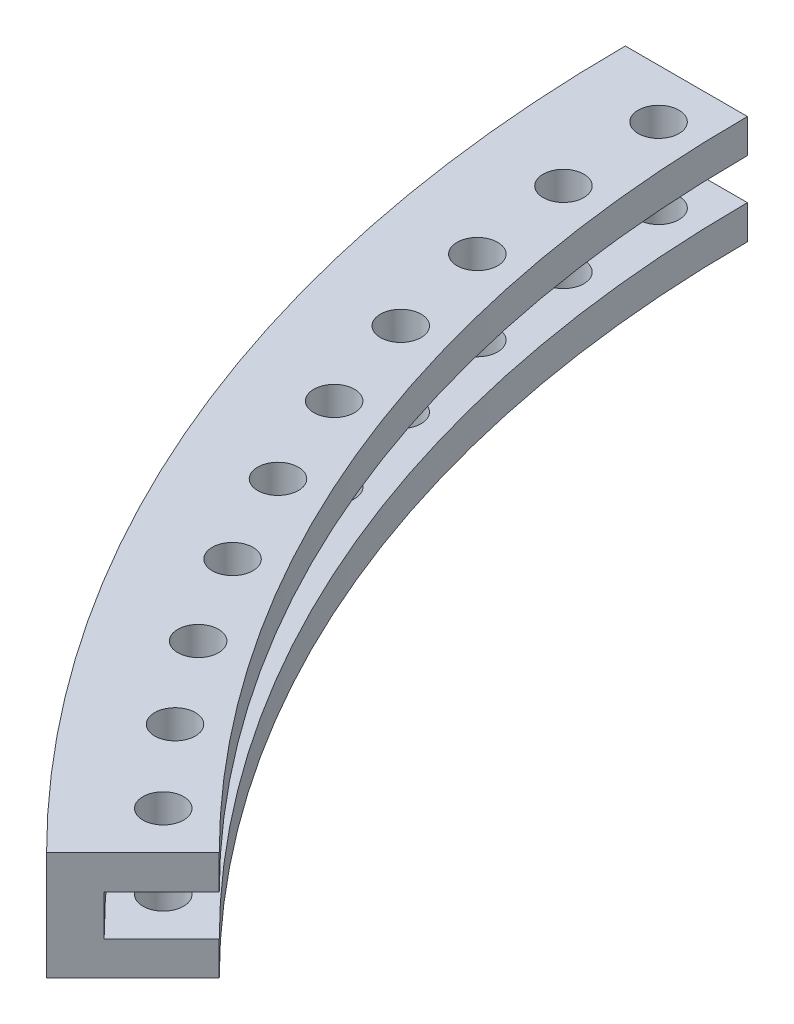
ISO-10303-21;
HEADER;
FILE_DESCRIPTION(('STEP AP214'),'2;1');
FILE_NAME('part.step','',(''),(''),'','','');
FILE_SCHEMA(('AUTOMOTIVE_DESIGN { 1 0 10303 214 1 1 1 1 }'));
ENDSEC;
DATA;
#1=APPLICATION_CONTEXT('core data for automotive mechanical design processes');
#2=APPLICATION_PROTOCOL_DEFINITION('international standard','automotive_design',2000,#1);
#3=PRODUCT_CONTEXT('',#1,'mechanical');
#4=PRODUCT('Part','Part','',(#3));
#5=PRODUCT_RELATED_PRODUCT_CATEGORY('part','',(#4));
#6=PRODUCT_DEFINITION_FORMATION('','',#4);
#7=PRODUCT_DEFINITION_CONTEXT('part definition',#1,'design');
#8=PRODUCT_DEFINITION('design','',#6,#7);
#9=PRODUCT_DEFINITION_SHAPE('','',#8);
#10=(LENGTH_UNIT() NAMED_UNIT(*) SI_UNIT(.MILLI.,.METRE.));
#11=(NAMED_UNIT(*) PLANE_ANGLE_UNIT() SI_UNIT($,.RADIAN.));
#12=(NAMED_UNIT(*) SI_UNIT($,.STERADIAN.) SOLID_ANGLE_UNIT());
#13=UNCERTAINTY_MEASURE_WITH_UNIT(LENGTH_MEASURE(1.E-05),#10,'distance_accuracy_value','');
#14=(GEOMETRIC_REPRESENTATION_CONTEXT(3) GLOBAL_UNCERTAINTY_ASSIGNED_CONTEXT((#13)) GLOBAL_UNIT_ASSIGNED_CONTEXT((#10,
#11,#12)) REPRESENTATION_CONTEXT('',''));
#15=CARTESIAN_POINT('',(0.,0.,0.));
#16=DIRECTION('',(0.,0.,1.));
#17=DIRECTION('',(1.,0.,0.));
#18=AXIS2_PLACEMENT_3D('',#15,#16,#17);
#19=CARTESIAN_POINT('',(-66.4680374315354,4.,66.4680374315356));
#20=DIRECTION('',(0.,-1.,0.));
#21=DIRECTION('',(0.,0.,-1.));
#22=AXIS2_PLACEMENT_3D('',#19,#20,#21);
#23=PLANE('',#22);
#24=CARTESIAN_POINT('',(-80.7590380226846,4.,53.7306037342833));
#25=DIRECTION('',(0.,1.,0.));
#26=DIRECTION('',(-0.156434465040231,0.,0.987688340595138));
#27=AXIS2_PLACEMENT_3D('',#24,#25,#26);
#28=CIRCLE('',#27,1.5);
#29=CARTESIAN_POINT('',(-80.993689720245,4.,55.212136245176));
#30=VERTEX_POINT('',#29);
#31=EDGE_CURVE('E587',#30,#30,#28,.T.);
#32=ORIENTED_EDGE('',*,*,#31,.F.);
#33=EDGE_LOOP('',(#32));
#34=FACE_BOUND('',#33,.T.);
#35=CARTESIAN_POINT('',(-84.7257394423301,4.,47.2286891195425));
#36=DIRECTION('',(0.,1.,0.));
#37=DIRECTION('',(-0.233445363855906,0.,0.972369920397676));
#38=AXIS2_PLACEMENT_3D('',#35,#36,#37);
#39=CIRCLE('',#38,1.5);
#40=CARTESIAN_POINT('',(-85.0759074881139,4.,48.687244000139));
#41=VERTEX_POINT('',#40);
#42=EDGE_CURVE('E583',#41,#41,#39,.T.);
#43=ORIENTED_EDGE('',*,*,#42,.F.);
#44=EDGE_LOOP('',(#43));
#45=FACE_BOUND('',#44,.T.);
#46=CARTESIAN_POINT('',(-88.1700785041463,4.,40.4355939312468));
#47=DIRECTION('',(0.,1.,0.));
#48=DIRECTION('',(-0.309016994374948,0.,0.951056516295154));
#49=AXIS2_PLACEMENT_3D('',#46,#47,#48);
#50=CIRCLE('',#49,1.5);
#51=CARTESIAN_POINT('',(-88.6336039957087,4.,41.8621787056896));
#52=VERTEX_POINT('',#51);
#53=EDGE_CURVE('E579',#52,#52,#50,.T.);
#54=ORIENTED_EDGE('',*,*,#53,.F.);
#55=EDGE_LOOP('',(#54));
#56=FACE_BOUND('',#55,.T.);
#57=CARTESIAN_POINT('',(-91.070819712458,4.,33.3931998601656));
#58=DIRECTION('',(0.,1.,0.));
#59=DIRECTION('',(-0.382683432365091,0.,0.923879532511287));
#60=AXIS2_PLACEMENT_3D('',#57,#58,#59);
#61=CIRCLE('',#60,1.5);
#62=CARTESIAN_POINT('',(-91.6448448610057,4.,34.7790191589325));
#63=VERTEX_POINT('',#62);
#64=EDGE_CURVE('E575',#63,#63,#61,.T.);
#65=ORIENTED_EDGE('',*,*,#64,.F.);
#66=EDGE_LOOP('',(#65));
#67=FACE_BOUND('',#66,.T.);
#68=CARTESIAN_POINT('',(-93.4100790331218,4.,26.1449256075807));
#69=DIRECTION('',(0.,1.,0.));
#70=DIRECTION('',(-0.453990499739548,0.,0.891006524188367));
#71=AXIS2_PLACEMENT_3D('',#68,#69,#70);
#72=CIRCLE('',#71,1.5);
#73=CARTESIAN_POINT('',(-94.0910647827312,4.,27.4814353938633));
#74=VERTEX_POINT('',#73);
#75=EDGE_CURVE('E571',#74,#74,#72,.T.);
#76=ORIENTED_EDGE('',*,*,#75,.F.);
#77=EDGE_LOOP('',(#76));
#78=FACE_BOUND('',#77,.T.);
#79=CARTESIAN_POINT('',(-95.1734341545432,4.,18.7354591945551));
#80=DIRECTION('',(0.,1.,0.));
#81=DIRECTION('',(-0.52249856471595,0.,0.852640164354092));
#82=AXIS2_PLACEMENT_3D('',#79,#80,#81);
#83=CIRCLE('',#82,1.5);
#84=CARTESIAN_POINT('',(-95.9571820016171,4.,20.0144194410862));
#85=VERTEX_POINT('',#84);
#86=EDGE_CURVE('E567',#85,#85,#83,.T.);
#87=ORIENTED_EDGE('',*,*,#86,.F.);
#88=EDGE_LOOP('',(#87));
#89=FACE_BOUND('',#88,.T.);
#90=CARTESIAN_POINT('',(-96.3500134060233,4.,11.2104824454226));
#91=DIRECTION('',(0.,1.,0.));
#92=DIRECTION('',(-0.587785252292474,0.,0.809016994374947));
#93=AXIS2_PLACEMENT_3D('',#90,#91,#92);
#94=CIRCLE('',#93,1.5);
#95=CARTESIAN_POINT('',(-97.231691284462,4.,12.424007936985));
#96=VERTEX_POINT('',#95);
#97=EDGE_CURVE('E563',#96,#96,#94,.T.);
#98=ORIENTED_EDGE('',*,*,#97,.F.);
#99=EDGE_LOOP('',(#98));
#100=FACE_BOUND('',#99,.T.);
#101=CARTESIAN_POINT('',(-96.9325627852246,4.,3.61638934415037));
#102=DIRECTION('',(0.,1.,0.));
#103=DIRECTION('',(-0.649448048330185,0.,0.76040596560003));
#104=AXIS2_PLACEMENT_3D('',#101,#102,#103);
#105=CIRCLE('',#104,1.5);
#106=CARTESIAN_POINT('',(-97.9067348577199,4.,4.75699829255041));
#107=VERTEX_POINT('',#106);
#108=EDGE_CURVE('E558',#107,#107,#105,.T.);
#109=ORIENTED_EDGE('',*,*,#108,.F.);
#110=EDGE_LOOP('',(#109));
#111=FACE_BOUND('',#110,.T.);
#112=CARTESIAN_POINT('',(-76.294430278524,4.,59.9012513097635));
#113=DIRECTION('',(0.,1.,0.));
#114=DIRECTION('',(-0.0784590957278451,0.,0.996917333733128));
#115=AXIS2_PLACEMENT_3D('',#112,#113,#114);
#116=CIRCLE('',#115,1.5);
#117=CARTESIAN_POINT('',(-76.4121189221158,4.,61.3966273103632));
#118=VERTEX_POINT('',#117);
#119=EDGE_CURVE('E216',#118,#118,#116,.T.);
#120=ORIENTED_EDGE('',*,*,#119,.F.);
#121=EDGE_LOOP('',(#120));
#122=FACE_BOUND('',#121,.T.);
#123=CARTESIAN_POINT('',(-71.3594420012237,4.,65.7025877517316));
#124=DIRECTION('',(0.,1.,0.));
#125=DIRECTION('',(0.,0.,1.));
#126=AXIS2_PLACEMENT_3D('',#123,#124,#125);
#127=CIRCLE('',#126,1.5);
#128=CARTESIAN_POINT('',(-71.3594420012237,4.,67.2025877517316));
#129=VERTEX_POINT('',#128);
#130=EDGE_CURVE('E223',#129,#129,#127,.T.);
#131=ORIENTED_EDGE('',*,*,#130,.F.);
#132=EDGE_LOOP('',(#131));
#133=FACE_BOUND('',#132,.T.);
#134=CARTESIAN_POINT('',(0.,4.,0.));
#135=DIRECTION('',(0.,-1.,0.));
#136=DIRECTION('',(0.,0.,-1.));
#137=AXIS2_PLACEMENT_3D('',#134,#135,#136);
#138=CIRCLE('',#137,103.);
#139=CARTESIAN_POINT('',(-72.8319984622143,4.,72.8319984622145));
#140=VERTEX_POINT('',#139);
#141=CARTESIAN_POINT('',(-103.,4.,0.));
#142=VERTEX_POINT('',#141);
#143=EDGE_CURVE('E11',#140,#142,#138,.T.);
#144=ORIENTED_EDGE('',*,*,#143,.F.);
#145=DIRECTION('',(-0.707106781186546,0.,0.707106781186549));
#146=VECTOR('',#145,1.);
#147=CARTESIAN_POINT('',(-66.4680374315354,4.,66.4680374315356));
#148=LINE('',#147,#146);
#149=CARTESIAN_POINT('',(-66.4680374315354,4.,66.4680374315356));
#150=VERTEX_POINT('',#149);
#151=EDGE_CURVE('E135',#150,#140,#148,.T.);
#152=ORIENTED_EDGE('',*,*,#151,.F.);
#153=CARTESIAN_POINT('',(0.,4.,0.));
#154=DIRECTION('',(0.,-1.,0.));
#155=DIRECTION('',(0.,0.,-1.));
#156=AXIS2_PLACEMENT_3D('',#153,#154,#155);
#157=CIRCLE('',#156,94.);
#158=CARTESIAN_POINT('',(-94.,4.,0.));
#159=VERTEX_POINT('',#158);
#160=EDGE_CURVE('E49',#150,#159,#157,.T.);
#161=ORIENTED_EDGE('',*,*,#160,.T.);
#162=DIRECTION('',(-1.,0.,0.));
#163=VECTOR('',#162,1.);
#164=CARTESIAN_POINT('',(-94.,4.,0.));
#165=LINE('',#164,#163);
#166=EDGE_CURVE('E109',#159,#142,#165,.T.);
#167=ORIENTED_EDGE('',*,*,#166,.T.);
#168=EDGE_LOOP('',(#144,#152,#161,#167));
#169=FACE_BOUND('',#168,.T.);
#170=ADVANCED_FACE('F32',(#34,#45,#56,#67,#78,#89,#100,#111,#122,#133,#169),#23,.F.);
#171=CARTESIAN_POINT('',(0.,-55.,0.));
#172=DIRECTION('',(0.,-1.,0.));
#173=DIRECTION('',(0.,0.,-1.));
#174=AXIS2_PLACEMENT_3D('',#171,#172,#173);
#175=CYLINDRICAL_SURFACE('',#174,103.);
#176=CARTESIAN_POINT('',(0.,-4.,0.));
#177=DIRECTION('',(0.,-1.,0.));
#178=DIRECTION('',(0.,0.,-1.));
#179=AXIS2_PLACEMENT_3D('',#176,#177,#178);
#180=CIRCLE('',#179,103.);
#181=CARTESIAN_POINT('',(-72.8319984622143,-4.,72.8319984622145));
#182=VERTEX_POINT('',#181);
#183=CARTESIAN_POINT('',(-103.,-4.,0.));
#184=VERTEX_POINT('',#183);
#185=EDGE_CURVE('E41',#182,#184,#180,.T.);
#186=ORIENTED_EDGE('',*,*,#185,.F.);
#187=DIRECTION('',(0.,-1.,0.));
#188=VECTOR('',#187,1.);
#189=CARTESIAN_POINT('',(-72.8319984622143,4.,72.8319984622145));
#190=LINE('',#189,#188);
#191=EDGE_CURVE('E105',#140,#182,#190,.T.);
#192=ORIENTED_EDGE('',*,*,#191,.F.);
#193=ORIENTED_EDGE('',*,*,#143,.T.);
#194=DIRECTION('',(0.,-1.,0.));
#195=VECTOR('',#194,1.);
#196=CARTESIAN_POINT('',(-103.,4.,0.));
#197=LINE('',#196,#195);
#198=EDGE_CURVE('E102',#142,#184,#197,.T.);
#199=ORIENTED_EDGE('',*,*,#198,.T.);
#200=EDGE_LOOP('',(#186,#192,#193,#199));
#201=FACE_BOUND('',#200,.T.);
#202=ADVANCED_FACE('F34',(#201),#175,.T.);
#203=CARTESIAN_POINT('',(-72.8319984622143,-4.,72.8319984622145));
#204=DIRECTION('',(0.,1.,0.));
#205=DIRECTION('',(0.,0.,1.));
#206=AXIS2_PLACEMENT_3D('',#203,#204,#205);
#207=PLANE('',#206);
#208=CARTESIAN_POINT('',(-80.7590380226846,-4.,53.7306037342833));
#209=DIRECTION('',(0.,1.,0.));
#210=DIRECTION('',(-0.156434465040231,0.,0.987688340595138));
#211=AXIS2_PLACEMENT_3D('',#208,#209,#210);
#212=CIRCLE('',#211,1.5);
#213=CARTESIAN_POINT('',(-80.993689720245,-4.,55.212136245176));
#214=VERTEX_POINT('',#213);
#215=EDGE_CURVE('E179',#214,#214,#212,.T.);
#216=ORIENTED_EDGE('',*,*,#215,.T.);
#217=EDGE_LOOP('',(#216));
#218=FACE_BOUND('',#217,.T.);
#219=CARTESIAN_POINT('',(-84.7257394423301,-4.,47.2286891195425));
#220=DIRECTION('',(0.,1.,0.));
#221=DIRECTION('',(-0.233445363855906,0.,0.972369920397676));
#222=AXIS2_PLACEMENT_3D('',#219,#220,#221);
#223=CIRCLE('',#222,1.5);
#224=CARTESIAN_POINT('',(-85.0759074881139,-4.,48.687244000139));
#225=VERTEX_POINT('',#224);
#226=EDGE_CURVE('E288',#225,#225,#223,.T.);
#227=ORIENTED_EDGE('',*,*,#226,.T.);
#228=EDGE_LOOP('',(#227));
#229=FACE_BOUND('',#228,.T.);
#230=CARTESIAN_POINT('',(-88.1700785041463,-4.,40.4355939312468));
#231=DIRECTION('',(0.,1.,0.));
#232=DIRECTION('',(-0.309016994374948,0.,0.951056516295154));
#233=AXIS2_PLACEMENT_3D('',#230,#231,#232);
#234=CIRCLE('',#233,1.5);
#235=CARTESIAN_POINT('',(-88.6336039957087,-4.,41.8621787056896));
#236=VERTEX_POINT('',#235);
#237=EDGE_CURVE('E292',#236,#236,#234,.T.);
#238=ORIENTED_EDGE('',*,*,#237,.T.);
#239=EDGE_LOOP('',(#238));
#240=FACE_BOUND('',#239,.T.);
#241=CARTESIAN_POINT('',(-91.070819712458,-4.,33.3931998601656));
#242=DIRECTION('',(0.,1.,0.));
#243=DIRECTION('',(-0.382683432365091,0.,0.923879532511287));
#244=AXIS2_PLACEMENT_3D('',#241,#242,#243);
#245=CIRCLE('',#244,1.5);
#246=CARTESIAN_POINT('',(-91.6448448610057,-4.,34.7790191589325));
#247=VERTEX_POINT('',#246);
#248=EDGE_CURVE('E296',#247,#247,#245,.T.);
#249=ORIENTED_EDGE('',*,*,#248,.T.);
#250=EDGE_LOOP('',(#249));
#251=FACE_BOUND('',#250,.T.);
#252=CARTESIAN_POINT('',(-93.4100790331218,-4.,26.1449256075807));
#253=DIRECTION('',(0.,1.,0.));
#254=DIRECTION('',(-0.453990499739548,0.,0.891006524188367));
#255=AXIS2_PLACEMENT_3D('',#252,#253,#254);
#256=CIRCLE('',#255,1.5);
#257=CARTESIAN_POINT('',(-94.0910647827312,-4.,27.4814353938633));
#258=VERTEX_POINT('',#257);
#259=EDGE_CURVE('E300',#258,#258,#256,.T.);
#260=ORIENTED_EDGE('',*,*,#259,.T.);
#261=EDGE_LOOP('',(#260));
#262=FACE_BOUND('',#261,.T.);
#263=CARTESIAN_POINT('',(-95.1734341545432,-4.,18.7354591945551));
#264=DIRECTION('',(0.,1.,0.));
#265=DIRECTION('',(-0.52249856471595,0.,0.852640164354092));
#266=AXIS2_PLACEMENT_3D('',#263,#264,#265);
#267=CIRCLE('',#266,1.5);
#268=CARTESIAN_POINT('',(-95.9571820016171,-4.,20.0144194410862));
#269=VERTEX_POINT('',#268);
#270=EDGE_CURVE('E304',#269,#269,#267,.T.);
#271=ORIENTED_EDGE('',*,*,#270,.T.);
#272=EDGE_LOOP('',(#271));
#273=FACE_BOUND('',#272,.T.);
#274=CARTESIAN_POINT('',(-96.3500134060233,-4.,11.2104824454226));
#275=DIRECTION('',(0.,1.,0.));
#276=DIRECTION('',(-0.587785252292474,0.,0.809016994374947));
#277=AXIS2_PLACEMENT_3D('',#274,#275,#276);
#278=CIRCLE('',#277,1.5);
#279=CARTESIAN_POINT('',(-97.231691284462,-4.,12.424007936985));
#280=VERTEX_POINT('',#279);
#281=EDGE_CURVE('E308',#280,#280,#278,.T.);
#282=ORIENTED_EDGE('',*,*,#281,.T.);
#283=EDGE_LOOP('',(#282));
#284=FACE_BOUND('',#283,.T.);
#285=CARTESIAN_POINT('',(-96.9325627852246,-4.,3.61638934415037));
#286=DIRECTION('',(0.,1.,0.));
#287=DIRECTION('',(-0.649448048330185,0.,0.76040596560003));
#288=AXIS2_PLACEMENT_3D('',#285,#286,#287);
#289=CIRCLE('',#288,1.5);
#290=CARTESIAN_POINT('',(-97.9067348577199,-4.,4.75699829255041));
#291=VERTEX_POINT('',#290);
#292=EDGE_CURVE('E312',#291,#291,#289,.T.);
#293=ORIENTED_EDGE('',*,*,#292,.T.);
#294=EDGE_LOOP('',(#293));
#295=FACE_BOUND('',#294,.T.);
#296=CARTESIAN_POINT('',(-76.294430278524,-4.,59.9012513097635));
#297=DIRECTION('',(0.,1.,0.));
#298=DIRECTION('',(-0.0784590957278451,0.,0.996917333733128));
#299=AXIS2_PLACEMENT_3D('',#296,#297,#298);
#300=CIRCLE('',#299,1.5);
#301=CARTESIAN_POINT('',(-76.4121189221158,-4.,61.3966273103632));
#302=VERTEX_POINT('',#301);
#303=EDGE_CURVE('E174',#302,#302,#300,.T.);
#304=ORIENTED_EDGE('',*,*,#303,.T.);
#305=EDGE_LOOP('',(#304));
#306=FACE_BOUND('',#305,.T.);
#307=CARTESIAN_POINT('',(-71.3594420012237,-4.,65.7025877517316));
#308=DIRECTION('',(0.,1.,0.));
#309=DIRECTION('',(0.,0.,1.));
#310=AXIS2_PLACEMENT_3D('',#307,#308,#309);
#311=CIRCLE('',#310,1.5);
#312=CARTESIAN_POINT('',(-71.3594420012237,-4.,67.2025877517316));
#313=VERTEX_POINT('',#312);
#314=EDGE_CURVE('E169',#313,#313,#311,.T.);
#315=ORIENTED_EDGE('',*,*,#314,.T.);
#316=EDGE_LOOP('',(#315));
#317=FACE_BOUND('',#316,.T.);
#318=CARTESIAN_POINT('',(0.,-4.,0.));
#319=DIRECTION('',(0.,-1.,0.));
#320=DIRECTION('',(0.,0.,-1.));
#321=AXIS2_PLACEMENT_3D('',#318,#319,#320);
#322=CIRCLE('',#321,94.);
#323=CARTESIAN_POINT('',(-66.4680374315354,-4.,66.4680374315356));
#324=VERTEX_POINT('',#323);
#325=CARTESIAN_POINT('',(-94.,-4.,0.));
#326=VERTEX_POINT('',#325);
#327=EDGE_CURVE('E163',#324,#326,#322,.T.);
#328=ORIENTED_EDGE('',*,*,#327,.F.);
#329=DIRECTION('',(0.707106781186546,0.,-0.707106781186549));
#330=VECTOR('',#329,1.);
#331=CARTESIAN_POINT('',(-72.8319984622143,-4.,72.8319984622145));
#332=LINE('',#331,#330);
#333=EDGE_CURVE('E138',#182,#324,#332,.T.);
#334=ORIENTED_EDGE('',*,*,#333,.F.);
#335=ORIENTED_EDGE('',*,*,#185,.T.);
#336=DIRECTION('',(1.,0.,0.));
#337=VECTOR('',#336,1.);
#338=CARTESIAN_POINT('',(-103.,-4.,0.));
#339=LINE('',#338,#337);
#340=EDGE_CURVE('E117',#184,#326,#339,.T.);
#341=ORIENTED_EDGE('',*,*,#340,.T.);
#342=EDGE_LOOP('',(#328,#334,#335,#341));
#343=FACE_BOUND('',#342,.T.);
#344=ADVANCED_FACE('F255',(#218,#229,#240,#251,#262,#273,#284,#295,#306,#317,#343),#207,.F.);
#345=CARTESIAN_POINT('',(0.,-55.,0.));
#346=DIRECTION('',(0.,-1.,0.));
#347=DIRECTION('',(0.,0.,-1.));
#348=AXIS2_PLACEMENT_3D('',#345,#346,#347);
#349=CYLINDRICAL_SURFACE('',#348,94.);
#350=CARTESIAN_POINT('',(0.,-1.5,0.));
#351=DIRECTION('',(0.,-1.,0.));
#352=DIRECTION('',(0.,0.,-1.));
#353=AXIS2_PLACEMENT_3D('',#350,#351,#352);
#354=CIRCLE('',#353,94.);
#355=CARTESIAN_POINT('',(-66.4680374315354,-1.5,66.4680374315356));
#356=VERTEX_POINT('',#355);
#357=CARTESIAN_POINT('',(-94.,-1.5,0.));
#358=VERTEX_POINT('',#357);
#359=EDGE_CURVE('E161',#356,#358,#354,.T.);
#360=ORIENTED_EDGE('',*,*,#359,.F.);
#361=DIRECTION('',(0.,1.,0.));
#362=VECTOR('',#361,1.);
#363=CARTESIAN_POINT('',(-66.4680374315354,-4.,66.4680374315356));
#364=LINE('',#363,#362);
#365=EDGE_CURVE('E141',#324,#356,#364,.T.);
#366=ORIENTED_EDGE('',*,*,#365,.F.);
#367=ORIENTED_EDGE('',*,*,#327,.T.);
#368=DIRECTION('',(0.,1.,0.));
#369=VECTOR('',#368,1.);
#370=CARTESIAN_POINT('',(-94.,-4.,0.));
#371=LINE('',#370,#369);
#372=EDGE_CURVE('E119',#326,#358,#371,.T.);
#373=ORIENTED_EDGE('',*,*,#372,.T.);
#374=EDGE_LOOP('',(#360,#366,#367,#373));
#375=FACE_BOUND('',#374,.T.);
#376=ADVANCED_FACE('F274',(#375),#349,.F.);
#377=CARTESIAN_POINT('',(-66.4680374315354,-1.5,66.4680374315356));
#378=DIRECTION('',(0.,-1.,0.));
#379=DIRECTION('',(0.,0.,-1.));
#380=AXIS2_PLACEMENT_3D('',#377,#378,#379);
#381=PLANE('',#380);
#382=CARTESIAN_POINT('',(-80.7590380226846,-1.5,53.7306037342833));
#383=DIRECTION('',(0.,-1.,0.));
#384=DIRECTION('',(0.,0.,-1.));
#385=AXIS2_PLACEMENT_3D('',#382,#383,#384);
#386=CIRCLE('',#385,1.5);
#387=CARTESIAN_POINT('',(-80.7590380226846,-1.5,52.2306037342833));
#388=VERTEX_POINT('',#387);
#389=EDGE_CURVE('E213',#388,#388,#386,.T.);
#390=ORIENTED_EDGE('',*,*,#389,.T.);
#391=EDGE_LOOP('',(#390));
#392=FACE_BOUND('',#391,.T.);
#393=CARTESIAN_POINT('',(-84.7257394423301,-1.5,47.2286891195425));
#394=DIRECTION('',(0.,-1.,0.));
#395=DIRECTION('',(0.,0.,-1.));
#396=AXIS2_PLACEMENT_3D('',#393,#394,#395);
#397=CIRCLE('',#396,1.5);
#398=CARTESIAN_POINT('',(-84.7257394423301,-1.5,45.7286891195425));
#399=VERTEX_POINT('',#398);
#400=EDGE_CURVE('E201',#399,#399,#397,.T.);
#401=ORIENTED_EDGE('',*,*,#400,.T.);
#402=EDGE_LOOP('',(#401));
#403=FACE_BOUND('',#402,.T.);
#404=CARTESIAN_POINT('',(-88.1700785041463,-1.5,40.4355939312468));
#405=DIRECTION('',(0.,-1.,0.));
#406=DIRECTION('',(0.,0.,-1.));
#407=AXIS2_PLACEMENT_3D('',#404,#405,#406);
#408=CIRCLE('',#407,1.5);
#409=CARTESIAN_POINT('',(-88.1700785041463,-1.5,38.9355939312469));
#410=VERTEX_POINT('',#409);
#411=EDGE_CURVE('E198',#410,#410,#408,.T.);
#412=ORIENTED_EDGE('',*,*,#411,.T.);
#413=EDGE_LOOP('',(#412));
#414=FACE_BOUND('',#413,.T.);
#415=CARTESIAN_POINT('',(-91.070819712458,-1.5,33.3931998601656));
#416=DIRECTION('',(0.,-1.,0.));
#417=DIRECTION('',(0.,0.,-1.));
#418=AXIS2_PLACEMENT_3D('',#415,#416,#417);
#419=CIRCLE('',#418,1.5);
#420=CARTESIAN_POINT('',(-91.070819712458,-1.5,31.8931998601656));
#421=VERTEX_POINT('',#420);
#422=EDGE_CURVE('E195',#421,#421,#419,.T.);
#423=ORIENTED_EDGE('',*,*,#422,.T.);
#424=EDGE_LOOP('',(#423));
#425=FACE_BOUND('',#424,.T.);
#426=CARTESIAN_POINT('',(-93.4100790331218,-1.5,26.1449256075807));
#427=DIRECTION('',(0.,-1.,0.));
#428=DIRECTION('',(0.,0.,-1.));
#429=AXIS2_PLACEMENT_3D('',#426,#427,#428);
#430=CIRCLE('',#429,1.5);
#431=CARTESIAN_POINT('',(-93.4100790331218,-1.5,24.6449256075807));
#432=VERTEX_POINT('',#431);
#433=EDGE_CURVE('E191',#432,#432,#430,.T.);
#434=ORIENTED_EDGE('',*,*,#433,.T.);
#435=EDGE_LOOP('',(#434));
#436=FACE_BOUND('',#435,.T.);
#437=CARTESIAN_POINT('',(-95.1734341545432,-1.5,18.7354591945551));
#438=DIRECTION('',(0.,-1.,0.));
#439=DIRECTION('',(0.,0.,-1.));
#440=AXIS2_PLACEMENT_3D('',#437,#438,#439);
#441=CIRCLE('',#440,1.5);
#442=CARTESIAN_POINT('',(-95.1734341545432,-1.5,17.2354591945551));
#443=VERTEX_POINT('',#442);
#444=EDGE_CURVE('E187',#443,#443,#441,.T.);
#445=ORIENTED_EDGE('',*,*,#444,.T.);
#446=EDGE_LOOP('',(#445));
#447=FACE_BOUND('',#446,.T.);
#448=CARTESIAN_POINT('',(-96.3500134060233,-1.5,11.2104824454226));
#449=DIRECTION('',(0.,-1.,0.));
#450=DIRECTION('',(0.,0.,-1.));
#451=AXIS2_PLACEMENT_3D('',#448,#449,#450);
#452=CIRCLE('',#451,1.5);
#453=CARTESIAN_POINT('',(-96.3500134060233,-1.5,9.71048244542258));
#454=VERTEX_POINT('',#453);
#455=EDGE_CURVE('E183',#454,#454,#452,.T.);
#456=ORIENTED_EDGE('',*,*,#455,.T.);
#457=EDGE_LOOP('',(#456));
#458=FACE_BOUND('',#457,.T.);
#459=CARTESIAN_POINT('',(-96.9325627852246,-1.5,3.61638934415037));
#460=DIRECTION('',(0.,-1.,0.));
#461=DIRECTION('',(0.,0.,-1.));
#462=AXIS2_PLACEMENT_3D('',#459,#460,#461);
#463=CIRCLE('',#462,1.5);
#464=CARTESIAN_POINT('',(-96.9325627852246,-1.5,2.11638934415037));
#465=VERTEX_POINT('',#464);
#466=EDGE_CURVE('E178',#465,#465,#463,.T.);
#467=ORIENTED_EDGE('',*,*,#466,.T.);
#468=EDGE_LOOP('',(#467));
#469=FACE_BOUND('',#468,.T.);
#470=CARTESIAN_POINT('',(-76.294430278524,-1.5,59.9012513097635));
#471=DIRECTION('',(0.,-1.,0.));
#472=DIRECTION('',(0.,0.,-1.));
#473=AXIS2_PLACEMENT_3D('',#470,#471,#472);
#474=CIRCLE('',#473,1.5);
#475=CARTESIAN_POINT('',(-76.294430278524,-1.5,58.4012513097635));
#476=VERTEX_POINT('',#475);
#477=EDGE_CURVE('E173',#476,#476,#474,.T.);
#478=ORIENTED_EDGE('',*,*,#477,.T.);
#479=EDGE_LOOP('',(#478));
#480=FACE_BOUND('',#479,.T.);
#481=CARTESIAN_POINT('',(-71.3594420012237,-1.5,65.7025877517316));
#482=DIRECTION('',(0.,-1.,0.));
#483=DIRECTION('',(0.,0.,-1.));
#484=AXIS2_PLACEMENT_3D('',#481,#482,#483);
#485=CIRCLE('',#484,1.5);
#486=CARTESIAN_POINT('',(-71.3594420012237,-1.5,64.2025877517316));
#487=VERTEX_POINT('',#486);
#488=EDGE_CURVE('E112',#487,#487,#485,.T.);
#489=ORIENTED_EDGE('',*,*,#488,.T.);
#490=EDGE_LOOP('',(#489));
#491=FACE_BOUND('',#490,.T.);
#492=CARTESIAN_POINT('',(0.,-1.5,0.));
#493=DIRECTION('',(0.,-1.,0.));
#494=DIRECTION('',(0.,0.,-1.));
#495=AXIS2_PLACEMENT_3D('',#492,#493,#494);
#496=CIRCLE('',#495,100.);
#497=CARTESIAN_POINT('',(-70.7106781186546,-1.5,70.7106781186549));
#498=VERTEX_POINT('',#497);
#499=CARTESIAN_POINT('',(-100.,-1.5,0.));
#500=VERTEX_POINT('',#499);
#501=EDGE_CURVE('E159',#498,#500,#496,.T.);
#502=ORIENTED_EDGE('',*,*,#501,.F.);
#503=DIRECTION('',(-0.707106781186546,0.,0.707106781186549));
#504=VECTOR('',#503,1.);
#505=CARTESIAN_POINT('',(-66.4680374315354,-1.5,66.4680374315356));
#506=LINE('',#505,#504);
#507=EDGE_CURVE('E144',#356,#498,#506,.T.);
#508=ORIENTED_EDGE('',*,*,#507,.F.);
#509=ORIENTED_EDGE('',*,*,#359,.T.);
#510=DIRECTION('',(-1.,0.,0.));
#511=VECTOR('',#510,1.);
#512=CARTESIAN_POINT('',(-94.,-1.5,0.));
#513=LINE('',#512,#511);
#514=EDGE_CURVE('E125',#358,#500,#513,.T.);
#515=ORIENTED_EDGE('',*,*,#514,.T.);
#516=EDGE_LOOP('',(#502,#508,#509,#515));
#517=FACE_BOUND('',#516,.T.);
#518=ADVANCED_FACE('F230',(#392,#403,#414,#425,#436,#447,#458,#469,#480,#491,#517),#381,.F.);
#519=CARTESIAN_POINT('',(0.,-55.,0.));
#520=DIRECTION('',(0.,-1.,0.));
#521=DIRECTION('',(0.,0.,-1.));
#522=AXIS2_PLACEMENT_3D('',#519,#520,#521);
#523=CYLINDRICAL_SURFACE('',#522,100.);
#524=CARTESIAN_POINT('',(0.,1.5,0.));
#525=DIRECTION('',(0.,-1.,0.));
#526=DIRECTION('',(0.,0.,-1.));
#527=AXIS2_PLACEMENT_3D('',#524,#525,#526);
#528=CIRCLE('',#527,100.);
#529=CARTESIAN_POINT('',(-70.7106781186546,1.5,70.7106781186549));
#530=VERTEX_POINT('',#529);
#531=CARTESIAN_POINT('',(-100.,1.5,0.));
#532=VERTEX_POINT('',#531);
#533=EDGE_CURVE('E157',#530,#532,#528,.T.);
#534=ORIENTED_EDGE('',*,*,#533,.F.);
#535=DIRECTION('',(0.,1.,0.));
#536=VECTOR('',#535,1.);
#537=CARTESIAN_POINT('',(-70.7106781186546,-1.5,70.7106781186549));
#538=LINE('',#537,#536);
#539=EDGE_CURVE('E147',#498,#530,#538,.T.);
#540=ORIENTED_EDGE('',*,*,#539,.F.);
#541=ORIENTED_EDGE('',*,*,#501,.T.);
#542=DIRECTION('',(0.,1.,0.));
#543=VECTOR('',#542,1.);
#544=CARTESIAN_POINT('',(-100.,-1.5,0.));
#545=LINE('',#544,#543);
#546=EDGE_CURVE('E128',#500,#532,#545,.T.);
#547=ORIENTED_EDGE('',*,*,#546,.T.);
#548=EDGE_LOOP('',(#534,#540,#541,#547));
#549=FACE_BOUND('',#548,.T.);
#550=ADVANCED_FACE('F267',(#549),#523,.F.);
#551=CARTESIAN_POINT('',(-70.7106781186546,1.5,70.7106781186549));
#552=DIRECTION('',(0.,1.,0.));
#553=DIRECTION('',(0.,0.,1.));
#554=AXIS2_PLACEMENT_3D('',#551,#552,#553);
#555=PLANE('',#554);
#556=CARTESIAN_POINT('',(-80.7590380226846,1.5,53.7306037342833));
#557=DIRECTION('',(0.,1.,0.));
#558=DIRECTION('',(0.,0.,1.));
#559=AXIS2_PLACEMENT_3D('',#556,#557,#558);
#560=CIRCLE('',#559,1.5);
#561=CARTESIAN_POINT('',(-80.7590380226846,1.5,55.2306037342833));
#562=VERTEX_POINT('',#561);
#563=EDGE_CURVE('E36',#562,#562,#560,.T.);
#564=ORIENTED_EDGE('',*,*,#563,.T.);
#565=EDGE_LOOP('',(#564));
#566=FACE_BOUND('',#565,.T.);
#567=CARTESIAN_POINT('',(-84.7257394423301,1.5,47.2286891195425));
#568=DIRECTION('',(0.,1.,0.));
#569=DIRECTION('',(0.,0.,1.));
#570=AXIS2_PLACEMENT_3D('',#567,#568,#569);
#571=CIRCLE('',#570,1.5);
#572=CARTESIAN_POINT('',(-84.7257394423301,1.5,48.7286891195425));
#573=VERTEX_POINT('',#572);
#574=EDGE_CURVE('E199',#573,#573,#571,.T.);
#575=ORIENTED_EDGE('',*,*,#574,.T.);
#576=EDGE_LOOP('',(#575));
#577=FACE_BOUND('',#576,.T.);
#578=CARTESIAN_POINT('',(-88.1700785041463,1.5,40.4355939312468));
#579=DIRECTION('',(0.,1.,0.));
#580=DIRECTION('',(0.,0.,1.));
#581=AXIS2_PLACEMENT_3D('',#578,#579,#580);
#582=CIRCLE('',#581,1.5);
#583=CARTESIAN_POINT('',(-88.1700785041463,1.5,41.9355939312468));
#584=VERTEX_POINT('',#583);
#585=EDGE_CURVE('E196',#584,#584,#582,.T.);
#586=ORIENTED_EDGE('',*,*,#585,.T.);
#587=EDGE_LOOP('',(#586));
#588=FACE_BOUND('',#587,.T.);
#589=CARTESIAN_POINT('',(-91.070819712458,1.5,33.3931998601656));
#590=DIRECTION('',(0.,1.,0.));
#591=DIRECTION('',(0.,0.,1.));
#592=AXIS2_PLACEMENT_3D('',#589,#590,#591);
#593=CIRCLE('',#592,1.5);
#594=CARTESIAN_POINT('',(-91.070819712458,1.5,34.8931998601656));
#595=VERTEX_POINT('',#594);
#596=EDGE_CURVE('E192',#595,#595,#593,.T.);
#597=ORIENTED_EDGE('',*,*,#596,.T.);
#598=EDGE_LOOP('',(#597));
#599=FACE_BOUND('',#598,.T.);
#600=CARTESIAN_POINT('',(-93.4100790331218,1.5,26.1449256075807));
#601=DIRECTION('',(0.,1.,0.));
#602=DIRECTION('',(0.,0.,1.));
#603=AXIS2_PLACEMENT_3D('',#600,#601,#602);
#604=CIRCLE('',#603,1.5);
#605=CARTESIAN_POINT('',(-93.4100790331218,1.5,27.6449256075807));
#606=VERTEX_POINT('',#605);
#607=EDGE_CURVE('E188',#606,#606,#604,.T.);
#608=ORIENTED_EDGE('',*,*,#607,.T.);
#609=EDGE_LOOP('',(#608));
#610=FACE_BOUND('',#609,.T.);
#611=CARTESIAN_POINT('',(-95.1734341545432,1.5,18.7354591945551));
#612=DIRECTION('',(0.,1.,0.));
#613=DIRECTION('',(0.,0.,1.));
#614=AXIS2_PLACEMENT_3D('',#611,#612,#613);
#615=CIRCLE('',#614,1.5);
#616=CARTESIAN_POINT('',(-95.1734341545432,1.5,20.2354591945551));
#617=VERTEX_POINT('',#616);
#618=EDGE_CURVE('E184',#617,#617,#615,.T.);
#619=ORIENTED_EDGE('',*,*,#618,.T.);
#620=EDGE_LOOP('',(#619));
#621=FACE_BOUND('',#620,.T.);
#622=CARTESIAN_POINT('',(-96.3500134060233,1.5,11.2104824454226));
#623=DIRECTION('',(0.,1.,0.));
#624=DIRECTION('',(0.,0.,1.));
#625=AXIS2_PLACEMENT_3D('',#622,#623,#624);
#626=CIRCLE('',#625,1.5);
#627=CARTESIAN_POINT('',(-96.3500134060233,1.5,12.7104824454226));
#628=VERTEX_POINT('',#627);
#629=EDGE_CURVE('E180',#628,#628,#626,.T.);
#630=ORIENTED_EDGE('',*,*,#629,.T.);
#631=EDGE_LOOP('',(#630));
#632=FACE_BOUND('',#631,.T.);
#633=CARTESIAN_POINT('',(-96.9325627852246,1.5,3.61638934415037));
#634=DIRECTION('',(0.,1.,0.));
#635=DIRECTION('',(0.,0.,1.));
#636=AXIS2_PLACEMENT_3D('',#633,#634,#635);
#637=CIRCLE('',#636,1.5);
#638=CARTESIAN_POINT('',(-96.9325627852246,1.5,5.11638934415036));
#639=VERTEX_POINT('',#638);
#640=EDGE_CURVE('E175',#639,#639,#637,.T.);
#641=ORIENTED_EDGE('',*,*,#640,.T.);
#642=EDGE_LOOP('',(#641));
#643=FACE_BOUND('',#642,.T.);
#644=CARTESIAN_POINT('',(-76.294430278524,1.5,59.9012513097635));
#645=DIRECTION('',(0.,1.,0.));
#646=DIRECTION('',(0.,0.,1.));
#647=AXIS2_PLACEMENT_3D('',#644,#645,#646);
#648=CIRCLE('',#647,1.5);
#649=CARTESIAN_POINT('',(-76.294430278524,1.5,61.4012513097635));
#650=VERTEX_POINT('',#649);
#651=EDGE_CURVE('E170',#650,#650,#648,.T.);
#652=ORIENTED_EDGE('',*,*,#651,.T.);
#653=EDGE_LOOP('',(#652));
#654=FACE_BOUND('',#653,.T.);
#655=CARTESIAN_POINT('',(-71.3594420012237,1.5,65.7025877517316));
#656=DIRECTION('',(0.,1.,0.));
#657=DIRECTION('',(0.,0.,1.));
#658=AXIS2_PLACEMENT_3D('',#655,#656,#657);
#659=CIRCLE('',#658,1.5);
#660=CARTESIAN_POINT('',(-71.3594420012237,1.5,67.2025877517316));
#661=VERTEX_POINT('',#660);
#662=EDGE_CURVE('E166',#661,#661,#659,.T.);
#663=ORIENTED_EDGE('',*,*,#662,.T.);
#664=EDGE_LOOP('',(#663));
#665=FACE_BOUND('',#664,.T.);
#666=CARTESIAN_POINT('',(0.,1.5,0.));
#667=DIRECTION('',(0.,-1.,0.));
#668=DIRECTION('',(0.,0.,-1.));
#669=AXIS2_PLACEMENT_3D('',#666,#667,#668);
#670=CIRCLE('',#669,94.);
#671=CARTESIAN_POINT('',(-66.4680374315354,1.5,66.4680374315356));
#672=VERTEX_POINT('',#671);
#673=CARTESIAN_POINT('',(-94.,1.5,0.));
#674=VERTEX_POINT('',#673);
#675=EDGE_CURVE('E57',#672,#674,#670,.T.);
#676=ORIENTED_EDGE('',*,*,#675,.F.);
#677=DIRECTION('',(0.707106781186546,0.,-0.707106781186549));
#678=VECTOR('',#677,1.);
#679=CARTESIAN_POINT('',(-70.7106781186546,1.5,70.7106781186549));
#680=LINE('',#679,#678);
#681=EDGE_CURVE('E150',#530,#672,#680,.T.);
#682=ORIENTED_EDGE('',*,*,#681,.F.);
#683=ORIENTED_EDGE('',*,*,#533,.T.);
#684=DIRECTION('',(1.,0.,0.));
#685=VECTOR('',#684,1.);
#686=CARTESIAN_POINT('',(-100.,1.5,0.));
#687=LINE('',#686,#685);
#688=EDGE_CURVE('E131',#532,#674,#687,.T.);
#689=ORIENTED_EDGE('',*,*,#688,.T.);
#690=EDGE_LOOP('',(#676,#682,#683,#689));
#691=FACE_BOUND('',#690,.T.);
#692=ADVANCED_FACE('F264',(#566,#577,#588,#599,#610,#621,#632,#643,#654,#665,#691),#555,.F.);
#693=CARTESIAN_POINT('',(0.,-55.,0.));
#694=DIRECTION('',(0.,-1.,0.));
#695=DIRECTION('',(0.,0.,-1.));
#696=AXIS2_PLACEMENT_3D('',#693,#694,#695);
#697=CYLINDRICAL_SURFACE('',#696,94.);
#698=DIRECTION('',(0.,1.,0.));
#699=VECTOR('',#698,1.);
#700=CARTESIAN_POINT('',(-66.4680374315354,1.5,66.4680374315356));
#701=LINE('',#700,#699);
#702=EDGE_CURVE('E152',#672,#150,#701,.T.);
#703=ORIENTED_EDGE('',*,*,#702,.F.);
#704=ORIENTED_EDGE('',*,*,#675,.T.);
#705=DIRECTION('',(0.,1.,0.));
#706=VECTOR('',#705,1.);
#707=CARTESIAN_POINT('',(-94.,1.5,0.));
#708=LINE('',#707,#706);
#709=EDGE_CURVE('E133',#674,#159,#708,.T.);
#710=ORIENTED_EDGE('',*,*,#709,.T.);
#711=ORIENTED_EDGE('',*,*,#160,.F.);
#712=EDGE_LOOP('',(#703,#704,#710,#711));
#713=FACE_BOUND('',#712,.T.);
#714=ADVANCED_FACE('F261',(#713),#697,.F.);
#715=CARTESIAN_POINT('',(0.,0.,0.));
#716=DIRECTION('',(0.707106781186549,0.,0.707106781186546));
#717=DIRECTION('',(0.707106781186546,0.,-0.707106781186549));
#718=AXIS2_PLACEMENT_3D('',#715,#716,#717);
#719=PLANE('',#718);
#720=ORIENTED_EDGE('',*,*,#151,.T.);
#721=ORIENTED_EDGE('',*,*,#191,.T.);
#722=ORIENTED_EDGE('',*,*,#333,.T.);
#723=ORIENTED_EDGE('',*,*,#365,.T.);
#724=ORIENTED_EDGE('',*,*,#507,.T.);
#725=ORIENTED_EDGE('',*,*,#539,.T.);
#726=ORIENTED_EDGE('',*,*,#681,.T.);
#727=ORIENTED_EDGE('',*,*,#702,.T.);
#728=EDGE_LOOP('',(#720,#721,#722,#723,#724,#725,#726,#727));
#729=FACE_BOUND('',#728,.T.);
#730=ADVANCED_FACE('F260',(#729),#719,.T.);
#731=CARTESIAN_POINT('',(0.,0.,0.));
#732=DIRECTION('',(0.,0.,1.));
#733=DIRECTION('',(1.,0.,0.));
#734=AXIS2_PLACEMENT_3D('',#731,#732,#733);
#735=PLANE('',#734);
#736=ORIENTED_EDGE('',*,*,#166,.F.);
#737=ORIENTED_EDGE('',*,*,#709,.F.);
#738=ORIENTED_EDGE('',*,*,#688,.F.);
#739=ORIENTED_EDGE('',*,*,#546,.F.);
#740=ORIENTED_EDGE('',*,*,#514,.F.);
#741=ORIENTED_EDGE('',*,*,#372,.F.);
#742=ORIENTED_EDGE('',*,*,#340,.F.);
#743=ORIENTED_EDGE('',*,*,#198,.F.);
#744=EDGE_LOOP('',(#736,#737,#738,#739,#740,#741,#742,#743));
#745=FACE_BOUND('',#744,.T.);
#746=ADVANCED_FACE('F114',(#745),#735,.F.);
#747=CARTESIAN_POINT('',(-71.3594420012237,-4.,65.7025877517316));
#748=DIRECTION('',(0.,1.,0.));
#749=DIRECTION('',(0.,0.,1.));
#750=AXIS2_PLACEMENT_3D('',#747,#748,#749);
#751=CYLINDRICAL_SURFACE('',#750,1.5);
#752=ORIENTED_EDGE('',*,*,#130,.T.);
#753=EDGE_LOOP('',(#752));
#754=FACE_BOUND('',#753,.T.);
#755=ORIENTED_EDGE('',*,*,#662,.F.);
#756=EDGE_LOOP('',(#755));
#757=FACE_BOUND('',#756,.T.);
#758=ADVANCED_FACE('F236',(#754,#757),#751,.F.);
#759=ORIENTED_EDGE('',*,*,#314,.F.);
#760=EDGE_LOOP('',(#759));
#761=FACE_BOUND('',#760,.T.);
#762=ORIENTED_EDGE('',*,*,#488,.F.);
#763=EDGE_LOOP('',(#762));
#764=FACE_BOUND('',#763,.T.);
#765=ADVANCED_FACE('F233',(#761,#764),#751,.F.);
#766=CARTESIAN_POINT('',(-76.294430278524,-4.,59.9012513097635));
#767=DIRECTION('',(0.,1.,0.));
#768=DIRECTION('',(0.,0.,1.));
#769=AXIS2_PLACEMENT_3D('',#766,#767,#768);
#770=CYLINDRICAL_SURFACE('',#769,1.5);
#771=ORIENTED_EDGE('',*,*,#119,.T.);
#772=EDGE_LOOP('',(#771));
#773=FACE_BOUND('',#772,.T.);
#774=ORIENTED_EDGE('',*,*,#651,.F.);
#775=EDGE_LOOP('',(#774));
#776=FACE_BOUND('',#775,.T.);
#777=ADVANCED_FACE('F235',(#773,#776),#770,.F.);
#778=ORIENTED_EDGE('',*,*,#303,.F.);
#779=EDGE_LOOP('',(#778));
#780=FACE_BOUND('',#779,.T.);
#781=ORIENTED_EDGE('',*,*,#477,.F.);
#782=EDGE_LOOP('',(#781));
#783=FACE_BOUND('',#782,.T.);
#784=ADVANCED_FACE('F243',(#780,#783),#770,.F.);
#785=CARTESIAN_POINT('',(-96.9325627852246,-4.,3.61638934415037));
#786=DIRECTION('',(0.,1.,0.));
#787=DIRECTION('',(0.,0.,1.));
#788=AXIS2_PLACEMENT_3D('',#785,#786,#787);
#789=CYLINDRICAL_SURFACE('',#788,1.5);
#790=ORIENTED_EDGE('',*,*,#108,.T.);
#791=EDGE_LOOP('',(#790));
#792=FACE_BOUND('',#791,.T.);
#793=ORIENTED_EDGE('',*,*,#640,.F.);
#794=EDGE_LOOP('',(#793));
#795=FACE_BOUND('',#794,.T.);
#796=ADVANCED_FACE('F377',(#792,#795),#789,.F.);
#797=CARTESIAN_POINT('',(-96.3500134060233,-4.,11.2104824454226));
#798=DIRECTION('',(0.,1.,0.));
#799=DIRECTION('',(0.,0.,1.));
#800=AXIS2_PLACEMENT_3D('',#797,#798,#799);
#801=CYLINDRICAL_SURFACE('',#800,1.5);
#802=ORIENTED_EDGE('',*,*,#97,.T.);
#803=EDGE_LOOP('',(#802));
#804=FACE_BOUND('',#803,.T.);
#805=ORIENTED_EDGE('',*,*,#629,.F.);
#806=EDGE_LOOP('',(#805));
#807=FACE_BOUND('',#806,.T.);
#808=ADVANCED_FACE('F386',(#804,#807),#801,.F.);
#809=CARTESIAN_POINT('',(-95.1734341545432,-4.,18.7354591945551));
#810=DIRECTION('',(0.,1.,0.));
#811=DIRECTION('',(0.,0.,1.));
#812=AXIS2_PLACEMENT_3D('',#809,#810,#811);
#813=CYLINDRICAL_SURFACE('',#812,1.5);
#814=ORIENTED_EDGE('',*,*,#86,.T.);
#815=EDGE_LOOP('',(#814));
#816=FACE_BOUND('',#815,.T.);
#817=ORIENTED_EDGE('',*,*,#618,.F.);
#818=EDGE_LOOP('',(#817));
#819=FACE_BOUND('',#818,.T.);
#820=ADVANCED_FACE('F397',(#816,#819),#813,.F.);
#821=CARTESIAN_POINT('',(-93.4100790331218,-4.,26.1449256075807));
#822=DIRECTION('',(0.,1.,0.));
#823=DIRECTION('',(0.,0.,1.));
#824=AXIS2_PLACEMENT_3D('',#821,#822,#823);
#825=CYLINDRICAL_SURFACE('',#824,1.5);
#826=ORIENTED_EDGE('',*,*,#75,.T.);
#827=EDGE_LOOP('',(#826));
#828=FACE_BOUND('',#827,.T.);
#829=ORIENTED_EDGE('',*,*,#607,.F.);
#830=EDGE_LOOP('',(#829));
#831=FACE_BOUND('',#830,.T.);
#832=ADVANCED_FACE('F408',(#828,#831),#825,.F.);
#833=CARTESIAN_POINT('',(-91.070819712458,-4.,33.3931998601656));
#834=DIRECTION('',(0.,1.,0.));
#835=DIRECTION('',(0.,0.,1.));
#836=AXIS2_PLACEMENT_3D('',#833,#834,#835);
#837=CYLINDRICAL_SURFACE('',#836,1.5);
#838=ORIENTED_EDGE('',*,*,#64,.T.);
#839=EDGE_LOOP('',(#838));
#840=FACE_BOUND('',#839,.T.);
#841=ORIENTED_EDGE('',*,*,#596,.F.);
#842=EDGE_LOOP('',(#841));
#843=FACE_BOUND('',#842,.T.);
#844=ADVANCED_FACE('F419',(#840,#843),#837,.F.);
#845=CARTESIAN_POINT('',(-88.1700785041463,-4.,40.4355939312468));
#846=DIRECTION('',(0.,1.,0.));
#847=DIRECTION('',(0.,0.,1.));
#848=AXIS2_PLACEMENT_3D('',#845,#846,#847);
#849=CYLINDRICAL_SURFACE('',#848,1.5);
#850=ORIENTED_EDGE('',*,*,#53,.T.);
#851=EDGE_LOOP('',(#850));
#852=FACE_BOUND('',#851,.T.);
#853=ORIENTED_EDGE('',*,*,#585,.F.);
#854=EDGE_LOOP('',(#853));
#855=FACE_BOUND('',#854,.T.);
#856=ADVANCED_FACE('F430',(#852,#855),#849,.F.);
#857=CARTESIAN_POINT('',(-84.7257394423301,-4.,47.2286891195425));
#858=DIRECTION('',(0.,1.,0.));
#859=DIRECTION('',(0.,0.,1.));
#860=AXIS2_PLACEMENT_3D('',#857,#858,#859);
#861=CYLINDRICAL_SURFACE('',#860,1.5);
#862=ORIENTED_EDGE('',*,*,#42,.T.);
#863=EDGE_LOOP('',(#862));
#864=FACE_BOUND('',#863,.T.);
#865=ORIENTED_EDGE('',*,*,#574,.F.);
#866=EDGE_LOOP('',(#865));
#867=FACE_BOUND('',#866,.T.);
#868=ADVANCED_FACE('F441',(#864,#867),#861,.F.);
#869=CARTESIAN_POINT('',(-80.7590380226846,-4.,53.7306037342833));
#870=DIRECTION('',(0.,1.,0.));
#871=DIRECTION('',(0.,0.,1.));
#872=AXIS2_PLACEMENT_3D('',#869,#870,#871);
#873=CYLINDRICAL_SURFACE('',#872,1.5);
#874=ORIENTED_EDGE('',*,*,#31,.T.);
#875=EDGE_LOOP('',(#874));
#876=FACE_BOUND('',#875,.T.);
#877=ORIENTED_EDGE('',*,*,#563,.F.);
#878=EDGE_LOOP('',(#877));
#879=FACE_BOUND('',#878,.T.);
#880=ADVANCED_FACE('F452',(#876,#879),#873,.F.);
#881=ORIENTED_EDGE('',*,*,#292,.F.);
#882=EDGE_LOOP('',(#881));
#883=FACE_BOUND('',#882,.T.);
#884=ORIENTED_EDGE('',*,*,#466,.F.);
#885=EDGE_LOOP('',(#884));
#886=FACE_BOUND('',#885,.T.);
#887=ADVANCED_FACE('F389',(#883,#886),#789,.F.);
#888=ORIENTED_EDGE('',*,*,#281,.F.);
#889=EDGE_LOOP('',(#888));
#890=FACE_BOUND('',#889,.T.);
#891=ORIENTED_EDGE('',*,*,#455,.F.);
#892=EDGE_LOOP('',(#891));
#893=FACE_BOUND('',#892,.T.);
#894=ADVANCED_FACE('F400',(#890,#893),#801,.F.);
#895=ORIENTED_EDGE('',*,*,#270,.F.);
#896=EDGE_LOOP('',(#895));
#897=FACE_BOUND('',#896,.T.);
#898=ORIENTED_EDGE('',*,*,#444,.F.);
#899=EDGE_LOOP('',(#898));
#900=FACE_BOUND('',#899,.T.);
#901=ADVANCED_FACE('F411',(#897,#900),#813,.F.);
#902=ORIENTED_EDGE('',*,*,#259,.F.);
#903=EDGE_LOOP('',(#902));
#904=FACE_BOUND('',#903,.T.);
#905=ORIENTED_EDGE('',*,*,#433,.F.);
#906=EDGE_LOOP('',(#905));
#907=FACE_BOUND('',#906,.T.);
#908=ADVANCED_FACE('F422',(#904,#907),#825,.F.);
#909=ORIENTED_EDGE('',*,*,#248,.F.);
#910=EDGE_LOOP('',(#909));
#911=FACE_BOUND('',#910,.T.);
#912=ORIENTED_EDGE('',*,*,#422,.F.);
#913=EDGE_LOOP('',(#912));
#914=FACE_BOUND('',#913,.T.);
#915=ADVANCED_FACE('F433',(#911,#914),#837,.F.);
#916=ORIENTED_EDGE('',*,*,#237,.F.);
#917=EDGE_LOOP('',(#916));
#918=FACE_BOUND('',#917,.T.);
#919=ORIENTED_EDGE('',*,*,#411,.F.);
#920=EDGE_LOOP('',(#919));
#921=FACE_BOUND('',#920,.T.);
#922=ADVANCED_FACE('F444',(#918,#921),#849,.F.);
#923=ORIENTED_EDGE('',*,*,#226,.F.);
#924=EDGE_LOOP('',(#923));
#925=FACE_BOUND('',#924,.T.);
#926=ORIENTED_EDGE('',*,*,#400,.F.);
#927=EDGE_LOOP('',(#926));
#928=FACE_BOUND('',#927,.T.);
#929=ADVANCED_FACE('F455',(#925,#928),#861,.F.);
#930=ORIENTED_EDGE('',*,*,#215,.F.);
#931=EDGE_LOOP('',(#930));
#932=FACE_BOUND('',#931,.T.);
#933=ORIENTED_EDGE('',*,*,#389,.F.);
#934=EDGE_LOOP('',(#933));
#935=FACE_BOUND('',#934,.T.);
#936=ADVANCED_FACE('F465',(#932,#935),#873,.F.);
#937=CLOSED_SHELL('',(#170,#202,#344,#376,#518,#550,#692,#714,#730,#746,#758,#765,#777,#784,
#796,#808,#820,#832,#844,#856,#868,#880,#887,#894,#901,#908,#915,#922,#929,#936));
#938=MANIFOLD_SOLID_BREP('B2',#937);
#939=ADVANCED_BREP_SHAPE_REPRESENTATION('',(#18,#938),#14);
#940=SHAPE_DEFINITION_REPRESENTATION(#9,#939);
ENDSEC;
END-ISO-10303-21;
